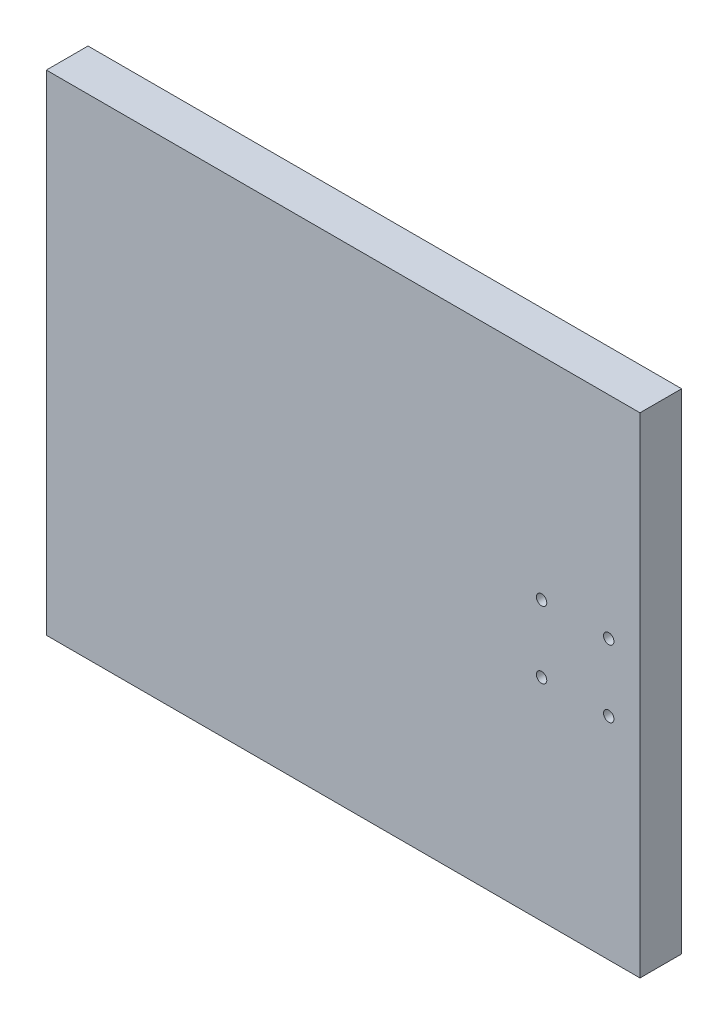
ISO-10303-21;
HEADER;
FILE_DESCRIPTION(('STEP AP214'),'2;1');
FILE_NAME('part.step','',(''),(''),'','','');
FILE_SCHEMA(('AUTOMOTIVE_DESIGN { 1 0 10303 214 1 1 1 1 }'));
ENDSEC;
DATA;
#1=APPLICATION_CONTEXT('core data for automotive mechanical design processes');
#2=APPLICATION_PROTOCOL_DEFINITION('international standard','automotive_design',2000,#1);
#3=PRODUCT_CONTEXT('',#1,'mechanical');
#4=PRODUCT('Part','Part','',(#3));
#5=PRODUCT_RELATED_PRODUCT_CATEGORY('part','',(#4));
#6=PRODUCT_DEFINITION_FORMATION('','',#4);
#7=PRODUCT_DEFINITION_CONTEXT('part definition',#1,'design');
#8=PRODUCT_DEFINITION('design','',#6,#7);
#9=PRODUCT_DEFINITION_SHAPE('','',#8);
#10=(LENGTH_UNIT() NAMED_UNIT(*) SI_UNIT(.MILLI.,.METRE.));
#11=(NAMED_UNIT(*) PLANE_ANGLE_UNIT() SI_UNIT($,.RADIAN.));
#12=(NAMED_UNIT(*) SI_UNIT($,.STERADIAN.) SOLID_ANGLE_UNIT());
#13=UNCERTAINTY_MEASURE_WITH_UNIT(LENGTH_MEASURE(1.E-05),#10,'distance_accuracy_value','');
#14=(GEOMETRIC_REPRESENTATION_CONTEXT(3) GLOBAL_UNCERTAINTY_ASSIGNED_CONTEXT((#13)) GLOBAL_UNIT_ASSIGNED_CONTEXT((#10,
#11,#12)) REPRESENTATION_CONTEXT('',''));
#15=CARTESIAN_POINT('',(0.,0.,0.));
#16=DIRECTION('',(0.,0.,1.));
#17=DIRECTION('',(1.,0.,0.));
#18=AXIS2_PLACEMENT_3D('',#15,#16,#17);
#19=CARTESIAN_POINT('',(285.,235.,-20.));
#20=DIRECTION('',(0.,1.,0.));
#21=DIRECTION('',(0.,0.,1.));
#22=AXIS2_PLACEMENT_3D('',#19,#20,#21);
#23=PLANE('',#22);
#24=DIRECTION('',(0.,0.,1.));
#25=VECTOR('',#24,1.);
#26=CARTESIAN_POINT('',(-285.,235.,-20.));
#27=LINE('',#26,#25);
#28=CARTESIAN_POINT('',(-285.,235.,-20.));
#29=VERTEX_POINT('',#28);
#30=CARTESIAN_POINT('',(-285.,235.,20.));
#31=VERTEX_POINT('',#30);
#32=EDGE_CURVE('E38',#29,#31,#27,.T.);
#33=ORIENTED_EDGE('',*,*,#32,.T.);
#34=DIRECTION('',(-1.,0.,0.));
#35=VECTOR('',#34,1.);
#36=CARTESIAN_POINT('',(285.,235.,20.));
#37=LINE('',#36,#35);
#38=CARTESIAN_POINT('',(285.,235.,20.));
#39=VERTEX_POINT('',#38);
#40=EDGE_CURVE('E107',#39,#31,#37,.T.);
#41=ORIENTED_EDGE('',*,*,#40,.F.);
#42=DIRECTION('',(0.,0.,1.));
#43=VECTOR('',#42,1.);
#44=CARTESIAN_POINT('',(285.,235.,-20.));
#45=LINE('',#44,#43);
#46=CARTESIAN_POINT('',(285.,235.,-20.));
#47=VERTEX_POINT('',#46);
#48=EDGE_CURVE('E11',#47,#39,#45,.T.);
#49=ORIENTED_EDGE('',*,*,#48,.F.);
#50=DIRECTION('',(-1.,0.,0.));
#51=VECTOR('',#50,1.);
#52=CARTESIAN_POINT('',(285.,235.,-20.));
#53=LINE('',#52,#51);
#54=EDGE_CURVE('E152',#47,#29,#53,.T.);
#55=ORIENTED_EDGE('',*,*,#54,.T.);
#56=EDGE_LOOP('',(#33,#41,#49,#55));
#57=FACE_BOUND('',#56,.T.);
#58=ADVANCED_FACE('F35',(#57),#23,.T.);
#59=CARTESIAN_POINT('',(285.,-235.,-20.));
#60=DIRECTION('',(1.,0.,0.));
#61=DIRECTION('',(0.,0.,-1.));
#62=AXIS2_PLACEMENT_3D('',#59,#60,#61);
#63=PLANE('',#62);
#64=ORIENTED_EDGE('',*,*,#48,.T.);
#65=DIRECTION('',(0.,1.,0.));
#66=VECTOR('',#65,1.);
#67=CARTESIAN_POINT('',(285.,-235.,20.));
#68=LINE('',#67,#66);
#69=CARTESIAN_POINT('',(285.,-235.,20.));
#70=VERTEX_POINT('',#69);
#71=EDGE_CURVE('E103',#70,#39,#68,.T.);
#72=ORIENTED_EDGE('',*,*,#71,.F.);
#73=DIRECTION('',(0.,0.,1.));
#74=VECTOR('',#73,1.);
#75=CARTESIAN_POINT('',(285.,-235.,-20.));
#76=LINE('',#75,#74);
#77=CARTESIAN_POINT('',(285.,-235.,-20.));
#78=VERTEX_POINT('',#77);
#79=EDGE_CURVE('E43',#78,#70,#76,.T.);
#80=ORIENTED_EDGE('',*,*,#79,.F.);
#81=DIRECTION('',(0.,1.,0.));
#82=VECTOR('',#81,1.);
#83=CARTESIAN_POINT('',(285.,-235.,-20.));
#84=LINE('',#83,#82);
#85=EDGE_CURVE('E105',#78,#47,#84,.T.);
#86=ORIENTED_EDGE('',*,*,#85,.T.);
#87=EDGE_LOOP('',(#64,#72,#80,#86));
#88=FACE_BOUND('',#87,.T.);
#89=ADVANCED_FACE('F101',(#88),#63,.T.);
#90=CARTESIAN_POINT('',(-285.,-235.,-20.));
#91=DIRECTION('',(0.,-1.,0.));
#92=DIRECTION('',(0.,0.,-1.));
#93=AXIS2_PLACEMENT_3D('',#90,#91,#92);
#94=PLANE('',#93);
#95=ORIENTED_EDGE('',*,*,#79,.T.);
#96=DIRECTION('',(1.,0.,0.));
#97=VECTOR('',#96,1.);
#98=CARTESIAN_POINT('',(-285.,-235.,20.));
#99=LINE('',#98,#97);
#100=CARTESIAN_POINT('',(-285.,-235.,20.));
#101=VERTEX_POINT('',#100);
#102=EDGE_CURVE('E116',#101,#70,#99,.T.);
#103=ORIENTED_EDGE('',*,*,#102,.F.);
#104=DIRECTION('',(0.,0.,1.));
#105=VECTOR('',#104,1.);
#106=CARTESIAN_POINT('',(-285.,-235.,-20.));
#107=LINE('',#106,#105);
#108=CARTESIAN_POINT('',(-285.,-235.,-20.));
#109=VERTEX_POINT('',#108);
#110=EDGE_CURVE('E168',#109,#101,#107,.T.);
#111=ORIENTED_EDGE('',*,*,#110,.F.);
#112=DIRECTION('',(1.,0.,0.));
#113=VECTOR('',#112,1.);
#114=CARTESIAN_POINT('',(-285.,-235.,-20.));
#115=LINE('',#114,#113);
#116=EDGE_CURVE('E164',#109,#78,#115,.T.);
#117=ORIENTED_EDGE('',*,*,#116,.T.);
#118=EDGE_LOOP('',(#95,#103,#111,#117));
#119=FACE_BOUND('',#118,.T.);
#120=ADVANCED_FACE('F174',(#119),#94,.T.);
#121=CARTESIAN_POINT('',(-285.,235.,-20.));
#122=DIRECTION('',(-1.,0.,0.));
#123=DIRECTION('',(0.,0.,1.));
#124=AXIS2_PLACEMENT_3D('',#121,#122,#123);
#125=PLANE('',#124);
#126=ORIENTED_EDGE('',*,*,#110,.T.);
#127=DIRECTION('',(0.,-1.,0.));
#128=VECTOR('',#127,1.);
#129=CARTESIAN_POINT('',(-285.,235.,20.));
#130=LINE('',#129,#128);
#131=EDGE_CURVE('E111',#31,#101,#130,.T.);
#132=ORIENTED_EDGE('',*,*,#131,.F.);
#133=ORIENTED_EDGE('',*,*,#32,.F.);
#134=DIRECTION('',(0.,-1.,0.));
#135=VECTOR('',#134,1.);
#136=CARTESIAN_POINT('',(-285.,235.,-20.));
#137=LINE('',#136,#135);
#138=EDGE_CURVE('E161',#29,#109,#137,.T.);
#139=ORIENTED_EDGE('',*,*,#138,.T.);
#140=EDGE_LOOP('',(#126,#132,#133,#139));
#141=FACE_BOUND('',#140,.T.);
#142=ADVANCED_FACE('F170',(#141),#125,.T.);
#143=CARTESIAN_POINT('',(0.,0.,-20.));
#144=DIRECTION('',(0.,0.,1.));
#145=DIRECTION('',(1.,0.,0.));
#146=AXIS2_PLACEMENT_3D('',#143,#144,#145);
#147=PLANE('',#146);
#148=DIRECTION('',(-1.,0.,0.));
#149=VECTOR('',#148,1.);
#150=CARTESIAN_POINT('',(275.,225.,-20.));
#151=LINE('',#150,#149);
#152=CARTESIAN_POINT('',(275.,225.,-20.));
#153=VERTEX_POINT('',#152);
#154=CARTESIAN_POINT('',(-275.,225.,-20.));
#155=VERTEX_POINT('',#154);
#156=EDGE_CURVE('E135',#153,#155,#151,.T.);
#157=ORIENTED_EDGE('',*,*,#156,.T.);
#158=DIRECTION('',(0.,-1.,0.));
#159=VECTOR('',#158,1.);
#160=CARTESIAN_POINT('',(-275.,225.,-20.));
#161=LINE('',#160,#159);
#162=CARTESIAN_POINT('',(-275.,-225.,-20.));
#163=VERTEX_POINT('',#162);
#164=EDGE_CURVE('E127',#155,#163,#161,.T.);
#165=ORIENTED_EDGE('',*,*,#164,.T.);
#166=DIRECTION('',(1.,0.,0.));
#167=VECTOR('',#166,1.);
#168=CARTESIAN_POINT('',(-275.,-225.,-20.));
#169=LINE('',#168,#167);
#170=CARTESIAN_POINT('',(275.,-225.,-20.));
#171=VERTEX_POINT('',#170);
#172=EDGE_CURVE('E130',#163,#171,#169,.T.);
#173=ORIENTED_EDGE('',*,*,#172,.T.);
#174=DIRECTION('',(0.,1.,0.));
#175=VECTOR('',#174,1.);
#176=CARTESIAN_POINT('',(275.,-225.,-20.));
#177=LINE('',#176,#175);
#178=EDGE_CURVE('E51',#171,#153,#177,.T.);
#179=ORIENTED_EDGE('',*,*,#178,.T.);
#180=EDGE_LOOP('',(#157,#165,#173,#179));
#181=FACE_BOUND('',#180,.T.);
#182=ORIENTED_EDGE('',*,*,#54,.F.);
#183=ORIENTED_EDGE('',*,*,#85,.F.);
#184=ORIENTED_EDGE('',*,*,#116,.F.);
#185=ORIENTED_EDGE('',*,*,#138,.F.);
#186=EDGE_LOOP('',(#182,#183,#184,#185));
#187=FACE_BOUND('',#186,.T.);
#188=ADVANCED_FACE('F176',(#181,#187),#147,.F.);
#189=CARTESIAN_POINT('',(-275.,225.,-20.));
#190=DIRECTION('',(-1.,0.,0.));
#191=DIRECTION('',(0.,0.,1.));
#192=AXIS2_PLACEMENT_3D('',#189,#190,#191);
#193=PLANE('',#192);
#194=DIRECTION('',(0.,-1.,0.));
#195=VECTOR('',#194,1.);
#196=CARTESIAN_POINT('',(-275.,225.,0.));
#197=LINE('',#196,#195);
#198=CARTESIAN_POINT('',(-275.,225.,0.));
#199=VERTEX_POINT('',#198);
#200=CARTESIAN_POINT('',(-275.,-225.,0.));
#201=VERTEX_POINT('',#200);
#202=EDGE_CURVE('E126',#199,#201,#197,.T.);
#203=ORIENTED_EDGE('',*,*,#202,.T.);
#204=DIRECTION('',(0.,0.,1.));
#205=VECTOR('',#204,1.);
#206=CARTESIAN_POINT('',(-275.,-225.,-20.));
#207=LINE('',#206,#205);
#208=EDGE_CURVE('E138',#163,#201,#207,.T.);
#209=ORIENTED_EDGE('',*,*,#208,.F.);
#210=ORIENTED_EDGE('',*,*,#164,.F.);
#211=DIRECTION('',(0.,0.,1.));
#212=VECTOR('',#211,1.);
#213=CARTESIAN_POINT('',(-275.,225.,-20.));
#214=LINE('',#213,#212);
#215=EDGE_CURVE('E149',#155,#199,#214,.T.);
#216=ORIENTED_EDGE('',*,*,#215,.T.);
#217=EDGE_LOOP('',(#203,#209,#210,#216));
#218=FACE_BOUND('',#217,.T.);
#219=ADVANCED_FACE('F178',(#218),#193,.F.);
#220=CARTESIAN_POINT('',(275.,225.,-20.));
#221=DIRECTION('',(0.,1.,0.));
#222=DIRECTION('',(0.,0.,1.));
#223=AXIS2_PLACEMENT_3D('',#220,#221,#222);
#224=PLANE('',#223);
#225=DIRECTION('',(-1.,0.,0.));
#226=VECTOR('',#225,1.);
#227=CARTESIAN_POINT('',(275.,225.,0.));
#228=LINE('',#227,#226);
#229=CARTESIAN_POINT('',(275.,225.,0.));
#230=VERTEX_POINT('',#229);
#231=EDGE_CURVE('E131',#230,#199,#228,.T.);
#232=ORIENTED_EDGE('',*,*,#231,.T.);
#233=ORIENTED_EDGE('',*,*,#215,.F.);
#234=ORIENTED_EDGE('',*,*,#156,.F.);
#235=DIRECTION('',(0.,0.,1.));
#236=VECTOR('',#235,1.);
#237=CARTESIAN_POINT('',(275.,225.,-20.));
#238=LINE('',#237,#236);
#239=EDGE_CURVE('E153',#153,#230,#238,.T.);
#240=ORIENTED_EDGE('',*,*,#239,.T.);
#241=EDGE_LOOP('',(#232,#233,#234,#240));
#242=FACE_BOUND('',#241,.T.);
#243=ADVANCED_FACE('F185',(#242),#224,.F.);
#244=CARTESIAN_POINT('',(275.,-225.,-20.));
#245=DIRECTION('',(1.,0.,0.));
#246=DIRECTION('',(0.,0.,-1.));
#247=AXIS2_PLACEMENT_3D('',#244,#245,#246);
#248=PLANE('',#247);
#249=DIRECTION('',(0.,1.,0.));
#250=VECTOR('',#249,1.);
#251=CARTESIAN_POINT('',(275.,-225.,0.));
#252=LINE('',#251,#250);
#253=CARTESIAN_POINT('',(275.,-225.,0.));
#254=VERTEX_POINT('',#253);
#255=EDGE_CURVE('E144',#254,#230,#252,.T.);
#256=ORIENTED_EDGE('',*,*,#255,.T.);
#257=ORIENTED_EDGE('',*,*,#239,.F.);
#258=ORIENTED_EDGE('',*,*,#178,.F.);
#259=DIRECTION('',(0.,0.,1.));
#260=VECTOR('',#259,1.);
#261=CARTESIAN_POINT('',(275.,-225.,-20.));
#262=LINE('',#261,#260);
#263=EDGE_CURVE('E156',#171,#254,#262,.T.);
#264=ORIENTED_EDGE('',*,*,#263,.T.);
#265=EDGE_LOOP('',(#256,#257,#258,#264));
#266=FACE_BOUND('',#265,.T.);
#267=ADVANCED_FACE('F221',(#266),#248,.F.);
#268=CARTESIAN_POINT('',(-275.,-225.,-20.));
#269=DIRECTION('',(0.,-1.,0.));
#270=DIRECTION('',(0.,0.,-1.));
#271=AXIS2_PLACEMENT_3D('',#268,#269,#270);
#272=PLANE('',#271);
#273=DIRECTION('',(1.,0.,0.));
#274=VECTOR('',#273,1.);
#275=CARTESIAN_POINT('',(-275.,-225.,0.));
#276=LINE('',#275,#274);
#277=EDGE_CURVE('E141',#201,#254,#276,.T.);
#278=ORIENTED_EDGE('',*,*,#277,.T.);
#279=ORIENTED_EDGE('',*,*,#263,.F.);
#280=ORIENTED_EDGE('',*,*,#172,.F.);
#281=ORIENTED_EDGE('',*,*,#208,.T.);
#282=EDGE_LOOP('',(#278,#279,#280,#281));
#283=FACE_BOUND('',#282,.T.);
#284=ADVANCED_FACE('F231',(#283),#272,.F.);
#285=CARTESIAN_POINT('',(0.,0.,0.));
#286=DIRECTION('',(0.,0.,1.));
#287=DIRECTION('',(1.,0.,0.));
#288=AXIS2_PLACEMENT_3D('',#285,#286,#287);
#289=PLANE('',#288);
#290=CARTESIAN_POINT('',(190.5,32.25,0.));
#291=DIRECTION('',(0.,0.,1.));
#292=DIRECTION('',(1.,0.,0.));
#293=AXIS2_PLACEMENT_3D('',#290,#291,#292);
#294=CIRCLE('',#293,4.99999999999999);
#295=CARTESIAN_POINT('',(195.5,32.25,0.));
#296=VERTEX_POINT('',#295);
#297=EDGE_CURVE('E306',#296,#296,#294,.T.);
#298=ORIENTED_EDGE('',*,*,#297,.T.);
#299=EDGE_LOOP('',(#298));
#300=FACE_BOUND('',#299,.T.);
#301=CARTESIAN_POINT('',(190.5,-32.25,0.));
#302=DIRECTION('',(0.,0.,1.));
#303=DIRECTION('',(1.,0.,0.));
#304=AXIS2_PLACEMENT_3D('',#301,#302,#303);
#305=CIRCLE('',#304,4.99999999999999);
#306=CARTESIAN_POINT('',(195.5,-32.25,0.));
#307=VERTEX_POINT('',#306);
#308=EDGE_CURVE('E314',#307,#307,#305,.T.);
#309=ORIENTED_EDGE('',*,*,#308,.T.);
#310=EDGE_LOOP('',(#309));
#311=FACE_BOUND('',#310,.T.);
#312=CARTESIAN_POINT('',(255.,32.25,0.));
#313=DIRECTION('',(0.,0.,1.));
#314=DIRECTION('',(1.,0.,0.));
#315=AXIS2_PLACEMENT_3D('',#312,#313,#314);
#316=CIRCLE('',#315,4.99999999999999);
#317=CARTESIAN_POINT('',(260.,32.25,0.));
#318=VERTEX_POINT('',#317);
#319=EDGE_CURVE('E320',#318,#318,#316,.T.);
#320=ORIENTED_EDGE('',*,*,#319,.T.);
#321=EDGE_LOOP('',(#320));
#322=FACE_BOUND('',#321,.T.);
#323=CARTESIAN_POINT('',(255.,-32.25,0.));
#324=DIRECTION('',(0.,0.,1.));
#325=DIRECTION('',(1.,0.,0.));
#326=AXIS2_PLACEMENT_3D('',#323,#324,#325);
#327=CIRCLE('',#326,4.99999999999999);
#328=CARTESIAN_POINT('',(260.,-32.25,0.));
#329=VERTEX_POINT('',#328);
#330=EDGE_CURVE('E117',#329,#329,#327,.T.);
#331=ORIENTED_EDGE('',*,*,#330,.T.);
#332=EDGE_LOOP('',(#331));
#333=FACE_BOUND('',#332,.T.);
#334=ORIENTED_EDGE('',*,*,#277,.F.);
#335=ORIENTED_EDGE('',*,*,#202,.F.);
#336=ORIENTED_EDGE('',*,*,#231,.F.);
#337=ORIENTED_EDGE('',*,*,#255,.F.);
#338=EDGE_LOOP('',(#334,#335,#336,#337));
#339=FACE_BOUND('',#338,.T.);
#340=ADVANCED_FACE('F240',(#300,#311,#322,#333,#339),#289,.F.);
#341=CARTESIAN_POINT('',(0.,0.,20.));
#342=DIRECTION('',(0.,0.,1.));
#343=DIRECTION('',(1.,0.,0.));
#344=AXIS2_PLACEMENT_3D('',#341,#342,#343);
#345=PLANE('',#344);
#346=CARTESIAN_POINT('',(190.5,32.25,20.));
#347=DIRECTION('',(0.,0.,1.));
#348=DIRECTION('',(1.,0.,0.));
#349=AXIS2_PLACEMENT_3D('',#346,#347,#348);
#350=CIRCLE('',#349,4.99999999999999);
#351=CARTESIAN_POINT('',(195.5,32.25,20.));
#352=VERTEX_POINT('',#351);
#353=EDGE_CURVE('E309',#352,#352,#350,.T.);
#354=ORIENTED_EDGE('',*,*,#353,.F.);
#355=EDGE_LOOP('',(#354));
#356=FACE_BOUND('',#355,.T.);
#357=CARTESIAN_POINT('',(190.5,-32.25,20.));
#358=DIRECTION('',(0.,0.,1.));
#359=DIRECTION('',(1.,0.,0.));
#360=AXIS2_PLACEMENT_3D('',#357,#358,#359);
#361=CIRCLE('',#360,4.99999999999999);
#362=CARTESIAN_POINT('',(195.5,-32.25,20.));
#363=VERTEX_POINT('',#362);
#364=EDGE_CURVE('E311',#363,#363,#361,.T.);
#365=ORIENTED_EDGE('',*,*,#364,.F.);
#366=EDGE_LOOP('',(#365));
#367=FACE_BOUND('',#366,.T.);
#368=CARTESIAN_POINT('',(255.,32.25,20.));
#369=DIRECTION('',(0.,0.,1.));
#370=DIRECTION('',(1.,0.,0.));
#371=AXIS2_PLACEMENT_3D('',#368,#369,#370);
#372=CIRCLE('',#371,4.99999999999999);
#373=CARTESIAN_POINT('',(260.,32.25,20.));
#374=VERTEX_POINT('',#373);
#375=EDGE_CURVE('E317',#374,#374,#372,.T.);
#376=ORIENTED_EDGE('',*,*,#375,.F.);
#377=EDGE_LOOP('',(#376));
#378=FACE_BOUND('',#377,.T.);
#379=CARTESIAN_POINT('',(255.,-32.25,20.));
#380=DIRECTION('',(0.,0.,1.));
#381=DIRECTION('',(1.,0.,0.));
#382=AXIS2_PLACEMENT_3D('',#379,#380,#381);
#383=CIRCLE('',#382,4.99999999999999);
#384=CARTESIAN_POINT('',(260.,-32.25,20.));
#385=VERTEX_POINT('',#384);
#386=EDGE_CURVE('E120',#385,#385,#383,.T.);
#387=ORIENTED_EDGE('',*,*,#386,.F.);
#388=EDGE_LOOP('',(#387));
#389=FACE_BOUND('',#388,.T.);
#390=ORIENTED_EDGE('',*,*,#71,.T.);
#391=ORIENTED_EDGE('',*,*,#40,.T.);
#392=ORIENTED_EDGE('',*,*,#131,.T.);
#393=ORIENTED_EDGE('',*,*,#102,.T.);
#394=EDGE_LOOP('',(#390,#391,#392,#393));
#395=FACE_BOUND('',#394,.T.);
#396=ADVANCED_FACE('F114',(#356,#367,#378,#389,#395),#345,.T.);
#397=CARTESIAN_POINT('',(255.,-32.25,0.));
#398=DIRECTION('',(0.,0.,1.));
#399=DIRECTION('',(1.,0.,0.));
#400=AXIS2_PLACEMENT_3D('',#397,#398,#399);
#401=CYLINDRICAL_SURFACE('',#400,4.99999999999999);
#402=ORIENTED_EDGE('',*,*,#330,.F.);
#403=EDGE_LOOP('',(#402));
#404=FACE_BOUND('',#403,.T.);
#405=ORIENTED_EDGE('',*,*,#386,.T.);
#406=EDGE_LOOP('',(#405));
#407=FACE_BOUND('',#406,.T.);
#408=ADVANCED_FACE('F248',(#404,#407),#401,.F.);
#409=CARTESIAN_POINT('',(255.,32.25,0.));
#410=DIRECTION('',(0.,0.,1.));
#411=DIRECTION('',(1.,0.,0.));
#412=AXIS2_PLACEMENT_3D('',#409,#410,#411);
#413=CYLINDRICAL_SURFACE('',#412,4.99999999999999);
#414=ORIENTED_EDGE('',*,*,#319,.F.);
#415=EDGE_LOOP('',(#414));
#416=FACE_BOUND('',#415,.T.);
#417=ORIENTED_EDGE('',*,*,#375,.T.);
#418=EDGE_LOOP('',(#417));
#419=FACE_BOUND('',#418,.T.);
#420=ADVANCED_FACE('F253',(#416,#419),#413,.F.);
#421=CARTESIAN_POINT('',(190.5,-32.25,0.));
#422=DIRECTION('',(0.,0.,1.));
#423=DIRECTION('',(1.,0.,0.));
#424=AXIS2_PLACEMENT_3D('',#421,#422,#423);
#425=CYLINDRICAL_SURFACE('',#424,4.99999999999999);
#426=ORIENTED_EDGE('',*,*,#308,.F.);
#427=EDGE_LOOP('',(#426));
#428=FACE_BOUND('',#427,.T.);
#429=ORIENTED_EDGE('',*,*,#364,.T.);
#430=EDGE_LOOP('',(#429));
#431=FACE_BOUND('',#430,.T.);
#432=ADVANCED_FACE('F265',(#428,#431),#425,.F.);
#433=CARTESIAN_POINT('',(190.5,32.25,0.));
#434=DIRECTION('',(0.,0.,1.));
#435=DIRECTION('',(1.,0.,0.));
#436=AXIS2_PLACEMENT_3D('',#433,#434,#435);
#437=CYLINDRICAL_SURFACE('',#436,4.99999999999999);
#438=ORIENTED_EDGE('',*,*,#297,.F.);
#439=EDGE_LOOP('',(#438));
#440=FACE_BOUND('',#439,.T.);
#441=ORIENTED_EDGE('',*,*,#353,.T.);
#442=EDGE_LOOP('',(#441));
#443=FACE_BOUND('',#442,.T.);
#444=ADVANCED_FACE('F275',(#440,#443),#437,.F.);
#445=CLOSED_SHELL('',(#58,#89,#120,#142,#188,#219,#243,#267,#284,#340,#396,#408,#420,#432,#444));
#446=MANIFOLD_SOLID_BREP('B2',#445);
#447=ADVANCED_BREP_SHAPE_REPRESENTATION('',(#18,#446),#14);
#448=SHAPE_DEFINITION_REPRESENTATION(#9,#447);
ENDSEC;
END-ISO-10303-21;
